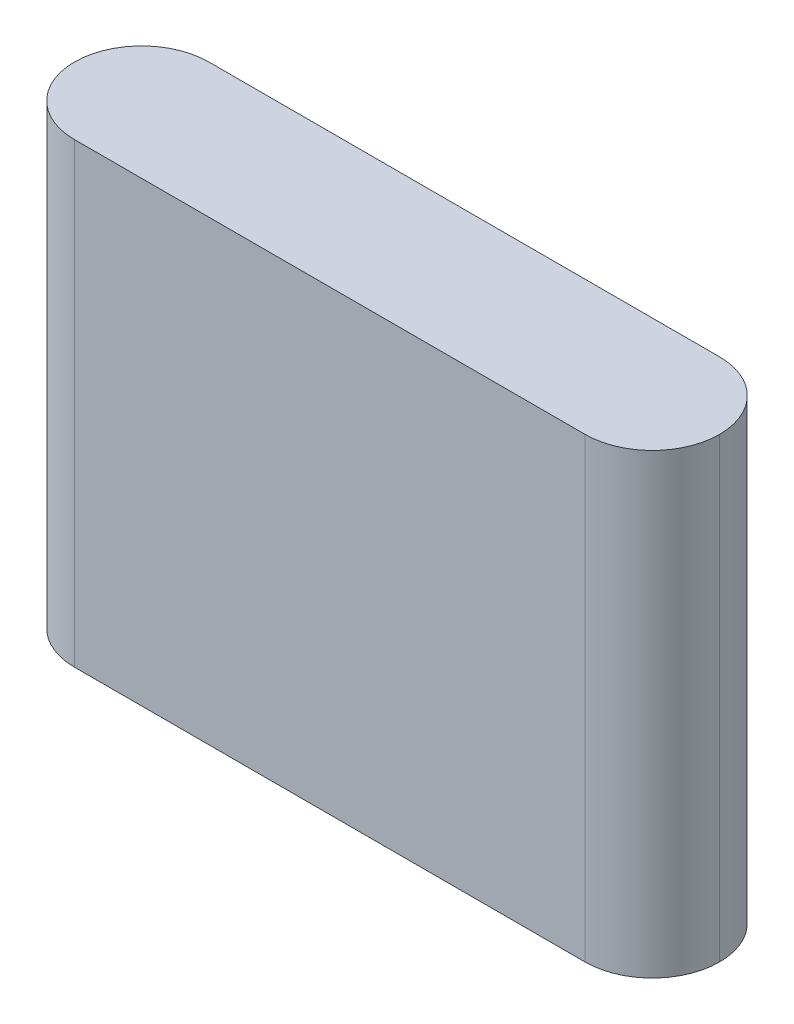
ISO-10303-21;
HEADER;
FILE_DESCRIPTION(('STEP AP214'),'2;1');
FILE_NAME('part.step','',(''),(''),'','','');
FILE_SCHEMA(('AUTOMOTIVE_DESIGN { 1 0 10303 214 1 1 1 1 }'));
ENDSEC;
DATA;
#1=APPLICATION_CONTEXT('core data for automotive mechanical design processes');
#2=APPLICATION_PROTOCOL_DEFINITION('international standard','automotive_design',2000,#1);
#3=PRODUCT_CONTEXT('',#1,'mechanical');
#4=PRODUCT('Part','Part','',(#3));
#5=PRODUCT_RELATED_PRODUCT_CATEGORY('part','',(#4));
#6=PRODUCT_DEFINITION_FORMATION('','',#4);
#7=PRODUCT_DEFINITION_CONTEXT('part definition',#1,'design');
#8=PRODUCT_DEFINITION('design','',#6,#7);
#9=PRODUCT_DEFINITION_SHAPE('','',#8);
#10=(LENGTH_UNIT() NAMED_UNIT(*) SI_UNIT(.MILLI.,.METRE.));
#11=(NAMED_UNIT(*) PLANE_ANGLE_UNIT() SI_UNIT($,.RADIAN.));
#12=(NAMED_UNIT(*) SI_UNIT($,.STERADIAN.) SOLID_ANGLE_UNIT());
#13=UNCERTAINTY_MEASURE_WITH_UNIT(LENGTH_MEASURE(1.E-05),#10,'distance_accuracy_value','');
#14=(GEOMETRIC_REPRESENTATION_CONTEXT(3) GLOBAL_UNCERTAINTY_ASSIGNED_CONTEXT((#13)) GLOBAL_UNIT_ASSIGNED_CONTEXT((#10,
#11,#12)) REPRESENTATION_CONTEXT('',''));
#15=CARTESIAN_POINT('',(0.,0.,0.));
#16=DIRECTION('',(0.,0.,1.));
#17=DIRECTION('',(1.,0.,0.));
#18=AXIS2_PLACEMENT_3D('',#15,#16,#17);
#19=CARTESIAN_POINT('',(-36.,25.5,15.));
#20=DIRECTION('',(0.,-1.,0.));
#21=DIRECTION('',(0.,0.,-1.));
#22=AXIS2_PLACEMENT_3D('',#19,#20,#21);
#23=PLANE('',#22);
#24=CARTESIAN_POINT('',(-28.5,25.5,7.5));
#25=DIRECTION('',(0.,-1.,0.));
#26=DIRECTION('',(0.,0.,-1.));
#27=AXIS2_PLACEMENT_3D('',#24,#25,#26);
#28=CIRCLE('',#27,7.5);
#29=CARTESIAN_POINT('',(-28.5,25.5,0.));
#30=VERTEX_POINT('',#29);
#31=CARTESIAN_POINT('',(-36.,25.5,7.5));
#32=VERTEX_POINT('',#31);
#33=EDGE_CURVE('E49',#30,#32,#28,.F.);
#34=ORIENTED_EDGE('',*,*,#33,.T.);
#35=CARTESIAN_POINT('',(-28.5,25.5,7.5));
#36=DIRECTION('',(0.,-1.,0.));
#37=DIRECTION('',(0.,0.,-1.));
#38=AXIS2_PLACEMENT_3D('',#35,#36,#37);
#39=CIRCLE('',#38,7.5);
#40=CARTESIAN_POINT('',(-28.5,25.5,15.));
#41=VERTEX_POINT('',#40);
#42=EDGE_CURVE('E108',#32,#41,#39,.F.);
#43=ORIENTED_EDGE('',*,*,#42,.T.);
#44=DIRECTION('',(-1.,0.,0.));
#45=VECTOR('',#44,1.);
#46=CARTESIAN_POINT('',(-36.,25.5,15.));
#47=LINE('',#46,#45);
#48=CARTESIAN_POINT('',(28.5,25.5,15.));
#49=VERTEX_POINT('',#48);
#50=EDGE_CURVE('E101',#49,#41,#47,.T.);
#51=ORIENTED_EDGE('',*,*,#50,.F.);
#52=CARTESIAN_POINT('',(28.5,25.5,7.5));
#53=DIRECTION('',(0.,-1.,0.));
#54=DIRECTION('',(0.,0.,-1.));
#55=AXIS2_PLACEMENT_3D('',#52,#53,#54);
#56=CIRCLE('',#55,7.5);
#57=CARTESIAN_POINT('',(36.,25.5,7.5));
#58=VERTEX_POINT('',#57);
#59=EDGE_CURVE('E88',#49,#58,#56,.F.);
#60=ORIENTED_EDGE('',*,*,#59,.T.);
#61=CARTESIAN_POINT('',(28.5,25.5,7.5));
#62=DIRECTION('',(0.,-1.,0.));
#63=DIRECTION('',(0.,0.,-1.));
#64=AXIS2_PLACEMENT_3D('',#61,#62,#63);
#65=CIRCLE('',#64,7.5);
#66=CARTESIAN_POINT('',(28.5,25.5,0.));
#67=VERTEX_POINT('',#66);
#68=EDGE_CURVE('E128',#58,#67,#65,.F.);
#69=ORIENTED_EDGE('',*,*,#68,.T.);
#70=DIRECTION('',(-1.,0.,0.));
#71=VECTOR('',#70,1.);
#72=CARTESIAN_POINT('',(-36.,25.5,0.));
#73=LINE('',#72,#71);
#74=EDGE_CURVE('E113',#67,#30,#73,.T.);
#75=ORIENTED_EDGE('',*,*,#74,.T.);
#76=EDGE_LOOP('',(#34,#43,#51,#60,#69,#75));
#77=FACE_BOUND('',#76,.T.);
#78=ADVANCED_FACE('F33',(#77),#23,.F.);
#79=CARTESIAN_POINT('',(-36.,-25.5,15.));
#80=DIRECTION('',(0.,1.,0.));
#81=DIRECTION('',(0.,0.,1.));
#82=AXIS2_PLACEMENT_3D('',#79,#80,#81);
#83=PLANE('',#82);
#84=DIRECTION('',(1.,0.,0.));
#85=VECTOR('',#84,1.);
#86=CARTESIAN_POINT('',(-36.,-25.5,15.));
#87=LINE('',#86,#85);
#88=CARTESIAN_POINT('',(-28.5,-25.5,15.));
#89=VERTEX_POINT('',#88);
#90=CARTESIAN_POINT('',(28.5,-25.5,15.));
#91=VERTEX_POINT('',#90);
#92=EDGE_CURVE('E104',#89,#91,#87,.T.);
#93=ORIENTED_EDGE('',*,*,#92,.F.);
#94=CARTESIAN_POINT('',(-28.5,-25.5,7.5));
#95=DIRECTION('',(0.,1.,0.));
#96=DIRECTION('',(0.,0.,1.));
#97=AXIS2_PLACEMENT_3D('',#94,#95,#96);
#98=CIRCLE('',#97,7.5);
#99=CARTESIAN_POINT('',(-36.,-25.5,7.5));
#100=VERTEX_POINT('',#99);
#101=EDGE_CURVE('E126',#89,#100,#98,.F.);
#102=ORIENTED_EDGE('',*,*,#101,.T.);
#103=CARTESIAN_POINT('',(-28.5,-25.5,7.5));
#104=DIRECTION('',(0.,1.,0.));
#105=DIRECTION('',(0.,0.,1.));
#106=AXIS2_PLACEMENT_3D('',#103,#104,#105);
#107=CIRCLE('',#106,7.5);
#108=CARTESIAN_POINT('',(-28.5,-25.5,0.));
#109=VERTEX_POINT('',#108);
#110=EDGE_CURVE('E124',#100,#109,#107,.F.);
#111=ORIENTED_EDGE('',*,*,#110,.T.);
#112=DIRECTION('',(1.,0.,0.));
#113=VECTOR('',#112,1.);
#114=CARTESIAN_POINT('',(-36.,-25.5,0.));
#115=LINE('',#114,#113);
#116=CARTESIAN_POINT('',(28.5,-25.5,0.));
#117=VERTEX_POINT('',#116);
#118=EDGE_CURVE('E109',#109,#117,#115,.T.);
#119=ORIENTED_EDGE('',*,*,#118,.T.);
#120=CARTESIAN_POINT('',(28.5,-25.5,7.5));
#121=DIRECTION('',(0.,1.,0.));
#122=DIRECTION('',(0.,0.,1.));
#123=AXIS2_PLACEMENT_3D('',#120,#121,#122);
#124=CIRCLE('',#123,7.5);
#125=CARTESIAN_POINT('',(36.,-25.5,7.5));
#126=VERTEX_POINT('',#125);
#127=EDGE_CURVE('E122',#117,#126,#124,.F.);
#128=ORIENTED_EDGE('',*,*,#127,.T.);
#129=CARTESIAN_POINT('',(28.5,-25.5,7.5));
#130=DIRECTION('',(0.,1.,0.));
#131=DIRECTION('',(0.,0.,1.));
#132=AXIS2_PLACEMENT_3D('',#129,#130,#131);
#133=CIRCLE('',#132,7.5);
#134=EDGE_CURVE('E118',#126,#91,#133,.F.);
#135=ORIENTED_EDGE('',*,*,#134,.T.);
#136=EDGE_LOOP('',(#93,#102,#111,#119,#128,#135));
#137=FACE_BOUND('',#136,.T.);
#138=ADVANCED_FACE('F137',(#137),#83,.F.);
#139=CARTESIAN_POINT('',(0.,0.,15.));
#140=DIRECTION('',(0.,0.,1.));
#141=DIRECTION('',(1.,0.,0.));
#142=AXIS2_PLACEMENT_3D('',#139,#140,#141);
#143=PLANE('',#142);
#144=ORIENTED_EDGE('',*,*,#50,.T.);
#145=DIRECTION('',(0.,-1.,0.));
#146=VECTOR('',#145,1.);
#147=CARTESIAN_POINT('',(-28.5,-25.5,15.));
#148=LINE('',#147,#146);
#149=EDGE_CURVE('E120',#41,#89,#148,.T.);
#150=ORIENTED_EDGE('',*,*,#149,.T.);
#151=ORIENTED_EDGE('',*,*,#92,.T.);
#152=DIRECTION('',(0.,1.,0.));
#153=VECTOR('',#152,1.);
#154=CARTESIAN_POINT('',(28.5,25.5,15.));
#155=LINE('',#154,#153);
#156=EDGE_CURVE('E92',#91,#49,#155,.T.);
#157=ORIENTED_EDGE('',*,*,#156,.T.);
#158=EDGE_LOOP('',(#144,#150,#151,#157));
#159=FACE_BOUND('',#158,.T.);
#160=ADVANCED_FACE('F99',(#159),#143,.T.);
#161=CARTESIAN_POINT('',(0.,0.,0.));
#162=DIRECTION('',(0.,0.,1.));
#163=DIRECTION('',(1.,0.,0.));
#164=AXIS2_PLACEMENT_3D('',#161,#162,#163);
#165=PLANE('',#164);
#166=ORIENTED_EDGE('',*,*,#118,.F.);
#167=DIRECTION('',(0.,-1.,0.));
#168=VECTOR('',#167,1.);
#169=CARTESIAN_POINT('',(-28.5,0.,0.));
#170=LINE('',#169,#168);
#171=EDGE_CURVE('E11',#109,#30,#170,.F.);
#172=ORIENTED_EDGE('',*,*,#171,.T.);
#173=ORIENTED_EDGE('',*,*,#74,.F.);
#174=DIRECTION('',(0.,1.,0.));
#175=VECTOR('',#174,1.);
#176=CARTESIAN_POINT('',(28.5,0.,0.));
#177=LINE('',#176,#175);
#178=EDGE_CURVE('E42',#67,#117,#177,.F.);
#179=ORIENTED_EDGE('',*,*,#178,.T.);
#180=EDGE_LOOP('',(#166,#172,#173,#179));
#181=FACE_BOUND('',#180,.T.);
#182=ADVANCED_FACE('F133',(#181),#165,.F.);
#183=CARTESIAN_POINT('',(28.5,0.,7.5));
#184=DIRECTION('',(0.,-1.,0.));
#185=DIRECTION('',(0.,0.,-1.));
#186=AXIS2_PLACEMENT_3D('',#183,#184,#185);
#187=CYLINDRICAL_SURFACE('',#186,7.5);
#188=ORIENTED_EDGE('',*,*,#134,.F.);
#189=DIRECTION('',(0.,1.,0.));
#190=VECTOR('',#189,1.);
#191=CARTESIAN_POINT('',(36.,-25.5,7.5));
#192=LINE('',#191,#190);
#193=EDGE_CURVE('E94',#58,#126,#192,.F.);
#194=ORIENTED_EDGE('',*,*,#193,.F.);
#195=ORIENTED_EDGE('',*,*,#59,.F.);
#196=ORIENTED_EDGE('',*,*,#156,.F.);
#197=EDGE_LOOP('',(#188,#194,#195,#196));
#198=FACE_BOUND('',#197,.T.);
#199=ADVANCED_FACE('F91',(#198),#187,.T.);
#200=CARTESIAN_POINT('',(-28.5,25.5,7.5));
#201=DIRECTION('',(0.,-1.,0.));
#202=DIRECTION('',(1.,0.,0.));
#203=AXIS2_PLACEMENT_3D('',#200,#201,#202);
#204=CYLINDRICAL_SURFACE('',#203,7.5);
#205=DIRECTION('',(0.,-1.,0.));
#206=VECTOR('',#205,1.);
#207=CARTESIAN_POINT('',(-36.,25.5,7.5));
#208=LINE('',#207,#206);
#209=EDGE_CURVE('E37',#32,#100,#208,.T.);
#210=ORIENTED_EDGE('',*,*,#209,.F.);
#211=ORIENTED_EDGE('',*,*,#33,.F.);
#212=ORIENTED_EDGE('',*,*,#171,.F.);
#213=ORIENTED_EDGE('',*,*,#110,.F.);
#214=EDGE_LOOP('',(#210,#211,#212,#213));
#215=FACE_BOUND('',#214,.T.);
#216=ADVANCED_FACE('F140',(#215),#204,.T.);
#217=CARTESIAN_POINT('',(-28.5,0.,7.5));
#218=DIRECTION('',(0.,1.,0.));
#219=DIRECTION('',(-1.,0.,0.));
#220=AXIS2_PLACEMENT_3D('',#217,#218,#219);
#221=CYLINDRICAL_SURFACE('',#220,7.5);
#222=ORIENTED_EDGE('',*,*,#42,.F.);
#223=ORIENTED_EDGE('',*,*,#209,.T.);
#224=ORIENTED_EDGE('',*,*,#101,.F.);
#225=ORIENTED_EDGE('',*,*,#149,.F.);
#226=EDGE_LOOP('',(#222,#223,#224,#225));
#227=FACE_BOUND('',#226,.T.);
#228=ADVANCED_FACE('F143',(#227),#221,.T.);
#229=CARTESIAN_POINT('',(28.5,25.5,7.5));
#230=DIRECTION('',(0.,1.,0.));
#231=DIRECTION('',(0.,0.,1.));
#232=AXIS2_PLACEMENT_3D('',#229,#230,#231);
#233=CYLINDRICAL_SURFACE('',#232,7.5);
#234=ORIENTED_EDGE('',*,*,#127,.F.);
#235=ORIENTED_EDGE('',*,*,#178,.F.);
#236=ORIENTED_EDGE('',*,*,#68,.F.);
#237=ORIENTED_EDGE('',*,*,#193,.T.);
#238=EDGE_LOOP('',(#234,#235,#236,#237));
#239=FACE_BOUND('',#238,.T.);
#240=ADVANCED_FACE('F35',(#239),#233,.T.);
#241=CLOSED_SHELL('',(#78,#138,#160,#182,#199,#216,#228,#240));
#242=MANIFOLD_SOLID_BREP('B2',#241);
#243=ADVANCED_BREP_SHAPE_REPRESENTATION('',(#18,#242),#14);
#244=SHAPE_DEFINITION_REPRESENTATION(#9,#243);
ENDSEC;
END-ISO-10303-21;
